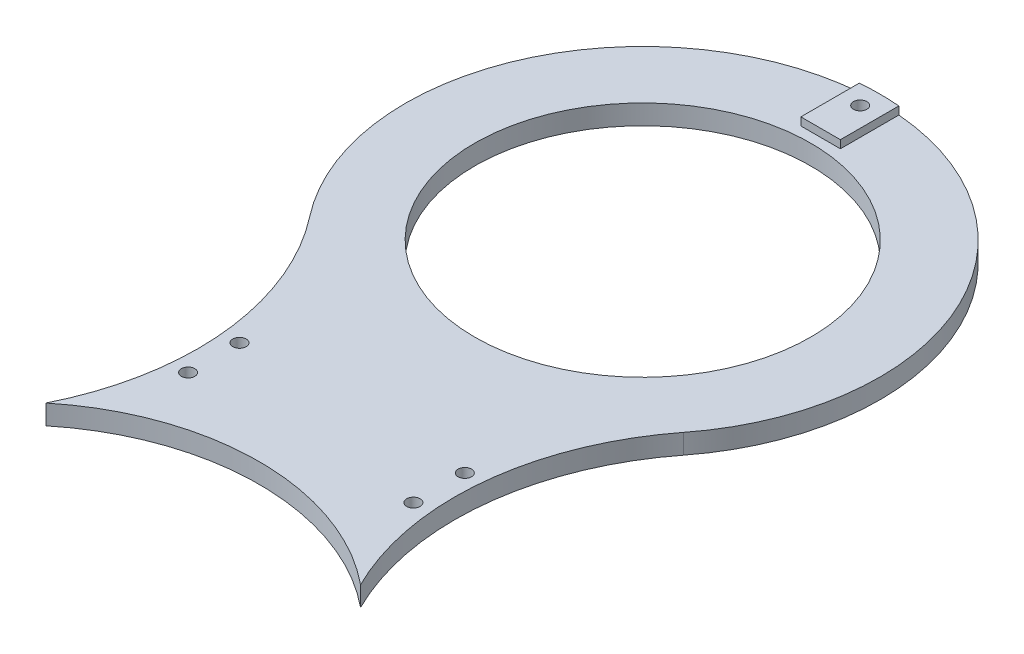
ISO-10303-21;
HEADER;
FILE_DESCRIPTION(('STEP AP214'),'2;1');
FILE_NAME('part.step','',(''),(''),'','','');
FILE_SCHEMA(('AUTOMOTIVE_DESIGN { 1 0 10303 214 1 1 1 1 }'));
ENDSEC;
DATA;
#1=APPLICATION_CONTEXT('core data for automotive mechanical design processes');
#2=APPLICATION_PROTOCOL_DEFINITION('international standard','automotive_design',2000,#1);
#3=PRODUCT_CONTEXT('',#1,'mechanical');
#4=PRODUCT('Part','Part','',(#3));
#5=PRODUCT_RELATED_PRODUCT_CATEGORY('part','',(#4));
#6=PRODUCT_DEFINITION_FORMATION('','',#4);
#7=PRODUCT_DEFINITION_CONTEXT('part definition',#1,'design');
#8=PRODUCT_DEFINITION('design','',#6,#7);
#9=PRODUCT_DEFINITION_SHAPE('','',#8);
#10=(LENGTH_UNIT() NAMED_UNIT(*) SI_UNIT(.MILLI.,.METRE.));
#11=(NAMED_UNIT(*) PLANE_ANGLE_UNIT() SI_UNIT($,.RADIAN.));
#12=(NAMED_UNIT(*) SI_UNIT($,.STERADIAN.) SOLID_ANGLE_UNIT());
#13=UNCERTAINTY_MEASURE_WITH_UNIT(LENGTH_MEASURE(1.E-05),#10,'distance_accuracy_value','');
#14=(GEOMETRIC_REPRESENTATION_CONTEXT(3) GLOBAL_UNCERTAINTY_ASSIGNED_CONTEXT((#13)) GLOBAL_UNIT_ASSIGNED_CONTEXT((#10,
#11,#12)) REPRESENTATION_CONTEXT('',''));
#15=CARTESIAN_POINT('',(0.,0.,0.));
#16=DIRECTION('',(0.,0.,1.));
#17=DIRECTION('',(1.,0.,0.));
#18=AXIS2_PLACEMENT_3D('',#15,#16,#17);
#19=CARTESIAN_POINT('',(0.,-14.,-215.));
#20=DIRECTION('',(0.,1.,0.));
#21=DIRECTION('',(0.,0.,1.));
#22=AXIS2_PLACEMENT_3D('',#19,#20,#21);
#23=CYLINDRICAL_SURFACE('',#22,1.7);
#24=CARTESIAN_POINT('',(0.,7.,-215.));
#25=DIRECTION('',(0.,1.,0.));
#26=DIRECTION('',(0.,0.,1.));
#27=AXIS2_PLACEMENT_3D('',#24,#25,#26);
#28=CIRCLE('',#27,1.7);
#29=CARTESIAN_POINT('',(0.,7.,-213.3));
#30=VERTEX_POINT('',#29);
#31=EDGE_CURVE('E166',#30,#30,#28,.T.);
#32=ORIENTED_EDGE('',*,*,#31,.T.);
#33=EDGE_LOOP('',(#32));
#34=FACE_BOUND('',#33,.T.);
#35=CARTESIAN_POINT('',(0.,3.,-215.));
#36=DIRECTION('',(0.,-1.,0.));
#37=DIRECTION('',(0.,0.,-1.));
#38=AXIS2_PLACEMENT_3D('',#35,#36,#37);
#39=CIRCLE('',#38,1.7);
#40=CARTESIAN_POINT('',(0.,3.,-216.7));
#41=VERTEX_POINT('',#40);
#42=EDGE_CURVE('E40',#41,#41,#39,.F.);
#43=ORIENTED_EDGE('',*,*,#42,.F.);
#44=EDGE_LOOP('',(#43));
#45=FACE_BOUND('',#44,.T.);
#46=ADVANCED_FACE('F36',(#34,#45),#23,.F.);
#47=CARTESIAN_POINT('',(51.2349101565567,5.,-40.0002002348816));
#48=DIRECTION('',(0.,1.,0.));
#49=DIRECTION('',(0.,0.,1.));
#50=AXIS2_PLACEMENT_3D('',#47,#48,#49);
#51=PLANE('',#50);
#52=CARTESIAN_POINT('',(-28.5,5.,-86.5));
#53=DIRECTION('',(0.,1.,0.));
#54=DIRECTION('',(0.,0.,1.));
#55=AXIS2_PLACEMENT_3D('',#52,#53,#54);
#56=CIRCLE('',#55,1.7);
#57=CARTESIAN_POINT('',(-28.5,5.,-84.8));
#58=VERTEX_POINT('',#57);
#59=EDGE_CURVE('E176',#58,#58,#56,.T.);
#60=ORIENTED_EDGE('',*,*,#59,.F.);
#61=EDGE_LOOP('',(#60));
#62=FACE_BOUND('',#61,.T.);
#63=CARTESIAN_POINT('',(-28.5,5.,-73.5));
#64=DIRECTION('',(0.,1.,0.));
#65=DIRECTION('',(0.,0.,1.));
#66=AXIS2_PLACEMENT_3D('',#63,#64,#65);
#67=CIRCLE('',#66,1.7);
#68=CARTESIAN_POINT('',(-28.5,5.,-71.8));
#69=VERTEX_POINT('',#68);
#70=EDGE_CURVE('E173',#69,#69,#67,.T.);
#71=ORIENTED_EDGE('',*,*,#70,.F.);
#72=EDGE_LOOP('',(#71));
#73=FACE_BOUND('',#72,.T.);
#74=CARTESIAN_POINT('',(28.5,5.,-73.5));
#75=DIRECTION('',(0.,1.,0.));
#76=DIRECTION('',(0.,0.,1.));
#77=AXIS2_PLACEMENT_3D('',#74,#75,#76);
#78=CIRCLE('',#77,1.7);
#79=CARTESIAN_POINT('',(28.5,5.,-71.8));
#80=VERTEX_POINT('',#79);
#81=EDGE_CURVE('E170',#80,#80,#78,.T.);
#82=ORIENTED_EDGE('',*,*,#81,.F.);
#83=EDGE_LOOP('',(#82));
#84=FACE_BOUND('',#83,.T.);
#85=CARTESIAN_POINT('',(28.5,5.,-86.5));
#86=DIRECTION('',(0.,1.,0.));
#87=DIRECTION('',(0.,0.,1.));
#88=AXIS2_PLACEMENT_3D('',#85,#86,#87);
#89=CIRCLE('',#88,1.7);
#90=CARTESIAN_POINT('',(28.5,5.,-84.8));
#91=VERTEX_POINT('',#90);
#92=EDGE_CURVE('E165',#91,#91,#89,.T.);
#93=ORIENTED_EDGE('',*,*,#92,.F.);
#94=EDGE_LOOP('',(#93));
#95=FACE_BOUND('',#94,.T.);
#96=DIRECTION('',(0.,0.,-1.));
#97=VECTOR('',#96,1.);
#98=CARTESIAN_POINT('',(5.00000000000002,5.,-205.));
#99=LINE('',#98,#97);
#100=CARTESIAN_POINT('',(5.00000000000002,5.,-205.));
#101=VERTEX_POINT('',#100);
#102=CARTESIAN_POINT('',(5.00000000000002,5.,-219.791303715507));
#103=VERTEX_POINT('',#102);
#104=EDGE_CURVE('E53',#101,#103,#99,.T.);
#105=ORIENTED_EDGE('',*,*,#104,.F.);
#106=DIRECTION('',(1.,0.,0.));
#107=VECTOR('',#106,1.);
#108=CARTESIAN_POINT('',(5.00000000000002,5.,-205.));
#109=LINE('',#108,#107);
#110=CARTESIAN_POINT('',(-4.99999999999998,5.,-205.));
#111=VERTEX_POINT('',#110);
#112=EDGE_CURVE('E121',#111,#101,#109,.T.);
#113=ORIENTED_EDGE('',*,*,#112,.F.);
#114=DIRECTION('',(0.,0.,1.));
#115=VECTOR('',#114,1.);
#116=CARTESIAN_POINT('',(-4.99999999999998,5.,-205.));
#117=LINE('',#116,#115);
#118=CARTESIAN_POINT('',(-4.99999999999998,5.,-219.791303715507));
#119=VERTEX_POINT('',#118);
#120=EDGE_CURVE('E59',#119,#111,#117,.T.);
#121=ORIENTED_EDGE('',*,*,#120,.F.);
#122=CARTESIAN_POINT('',(0.,5.,-160.));
#123=DIRECTION('',(0.,1.,0.));
#124=DIRECTION('',(0.,0.,1.));
#125=AXIS2_PLACEMENT_3D('',#122,#123,#124);
#126=CIRCLE('',#125,60.);
#127=CARTESIAN_POINT('',(-47.2937632214369,5.,-123.077107909121));
#128=VERTEX_POINT('',#127);
#129=EDGE_CURVE('E139',#119,#128,#126,.T.);
#130=ORIENTED_EDGE('',*,*,#129,.T.);
#131=CARTESIAN_POINT('',(-102.469820313113,5.,-80.0004004697632));
#132=DIRECTION('',(0.,-1.,0.));
#133=DIRECTION('',(0.,0.,1.));
#134=AXIS2_PLACEMENT_3D('',#131,#132,#133);
#135=CIRCLE('',#134,70.);
#136=CARTESIAN_POINT('',(-39.7828794835165,5.,-48.85));
#137=VERTEX_POINT('',#136);
#138=EDGE_CURVE('E143',#128,#137,#135,.T.);
#139=ORIENTED_EDGE('',*,*,#138,.T.);
#140=CARTESIAN_POINT('',(0.,5.,0.));
#141=DIRECTION('',(0.,-1.,0.));
#142=DIRECTION('',(0.,0.,1.));
#143=AXIS2_PLACEMENT_3D('',#140,#141,#142);
#144=CIRCLE('',#143,63.);
#145=CARTESIAN_POINT('',(39.7828794835165,5.,-48.85));
#146=VERTEX_POINT('',#145);
#147=EDGE_CURVE('E145',#137,#146,#144,.T.);
#148=ORIENTED_EDGE('',*,*,#147,.T.);
#149=CARTESIAN_POINT('',(102.469820313113,5.,-80.0004004697632));
#150=DIRECTION('',(0.,-1.,0.));
#151=DIRECTION('',(0.,0.,1.));
#152=AXIS2_PLACEMENT_3D('',#149,#150,#151);
#153=CIRCLE('',#152,70.);
#154=CARTESIAN_POINT('',(47.2937632214369,5.,-123.077107909121));
#155=VERTEX_POINT('',#154);
#156=EDGE_CURVE('E136',#146,#155,#153,.T.);
#157=ORIENTED_EDGE('',*,*,#156,.T.);
#158=EDGE_CURVE('E141',#155,#103,#126,.T.);
#159=ORIENTED_EDGE('',*,*,#158,.T.);
#160=EDGE_LOOP('',(#105,#113,#121,#130,#139,#148,#157,#159));
#161=FACE_BOUND('',#160,.T.);
#162=CARTESIAN_POINT('',(0.,5.,-160.));
#163=DIRECTION('',(0.,1.,0.));
#164=DIRECTION('',(0.,0.,1.));
#165=AXIS2_PLACEMENT_3D('',#162,#163,#164);
#166=CIRCLE('',#165,42.5);
#167=CARTESIAN_POINT('',(0.,5.,-117.5));
#168=VERTEX_POINT('',#167);
#169=EDGE_CURVE('E127',#168,#168,#166,.T.);
#170=ORIENTED_EDGE('',*,*,#169,.F.);
#171=EDGE_LOOP('',(#170));
#172=FACE_BOUND('',#171,.T.);
#173=ADVANCED_FACE('F210',(#62,#73,#84,#95,#161,#172),#51,.T.);
#174=CARTESIAN_POINT('',(51.2349101565567,0.,-40.0002002348816));
#175=DIRECTION('',(0.,1.,0.));
#176=DIRECTION('',(0.,0.,1.));
#177=AXIS2_PLACEMENT_3D('',#174,#175,#176);
#178=PLANE('',#177);
#179=CARTESIAN_POINT('',(0.,0.,-215.));
#180=DIRECTION('',(0.,-1.,0.));
#181=DIRECTION('',(0.,0.,-1.));
#182=AXIS2_PLACEMENT_3D('',#179,#180,#181);
#183=CIRCLE('',#182,2.95);
#184=CARTESIAN_POINT('',(0.,0.,-217.95));
#185=VERTEX_POINT('',#184);
#186=EDGE_CURVE('E250',#185,#185,#183,.T.);
#187=ORIENTED_EDGE('',*,*,#186,.F.);
#188=EDGE_LOOP('',(#187));
#189=FACE_BOUND('',#188,.T.);
#190=CARTESIAN_POINT('',(-28.5,0.,-86.5));
#191=DIRECTION('',(0.,1.,0.));
#192=DIRECTION('',(0.,0.,1.));
#193=AXIS2_PLACEMENT_3D('',#190,#191,#192);
#194=CIRCLE('',#193,1.7);
#195=CARTESIAN_POINT('',(-28.5,0.,-84.8));
#196=VERTEX_POINT('',#195);
#197=EDGE_CURVE('E174',#196,#196,#194,.T.);
#198=ORIENTED_EDGE('',*,*,#197,.T.);
#199=EDGE_LOOP('',(#198));
#200=FACE_BOUND('',#199,.T.);
#201=CARTESIAN_POINT('',(-28.5,0.,-73.5));
#202=DIRECTION('',(0.,1.,0.));
#203=DIRECTION('',(0.,0.,1.));
#204=AXIS2_PLACEMENT_3D('',#201,#202,#203);
#205=CIRCLE('',#204,1.7);
#206=CARTESIAN_POINT('',(-28.5,0.,-71.8));
#207=VERTEX_POINT('',#206);
#208=EDGE_CURVE('E171',#207,#207,#205,.T.);
#209=ORIENTED_EDGE('',*,*,#208,.T.);
#210=EDGE_LOOP('',(#209));
#211=FACE_BOUND('',#210,.T.);
#212=CARTESIAN_POINT('',(28.5,0.,-73.5));
#213=DIRECTION('',(0.,1.,0.));
#214=DIRECTION('',(0.,0.,1.));
#215=AXIS2_PLACEMENT_3D('',#212,#213,#214);
#216=CIRCLE('',#215,1.7);
#217=CARTESIAN_POINT('',(28.5,0.,-71.8));
#218=VERTEX_POINT('',#217);
#219=EDGE_CURVE('E167',#218,#218,#216,.T.);
#220=ORIENTED_EDGE('',*,*,#219,.T.);
#221=EDGE_LOOP('',(#220));
#222=FACE_BOUND('',#221,.T.);
#223=CARTESIAN_POINT('',(28.5,0.,-86.5));
#224=DIRECTION('',(0.,1.,0.));
#225=DIRECTION('',(0.,0.,1.));
#226=AXIS2_PLACEMENT_3D('',#223,#224,#225);
#227=CIRCLE('',#226,1.7);
#228=CARTESIAN_POINT('',(28.5,0.,-84.8));
#229=VERTEX_POINT('',#228);
#230=EDGE_CURVE('E162',#229,#229,#227,.T.);
#231=ORIENTED_EDGE('',*,*,#230,.T.);
#232=EDGE_LOOP('',(#231));
#233=FACE_BOUND('',#232,.T.);
#234=CARTESIAN_POINT('',(102.469820313113,0.,-80.0004004697632));
#235=DIRECTION('',(0.,-1.,0.));
#236=DIRECTION('',(0.,0.,1.));
#237=AXIS2_PLACEMENT_3D('',#234,#235,#236);
#238=CIRCLE('',#237,70.);
#239=CARTESIAN_POINT('',(39.7828794835165,0.,-48.85));
#240=VERTEX_POINT('',#239);
#241=CARTESIAN_POINT('',(47.2937632214369,0.,-123.077107909121));
#242=VERTEX_POINT('',#241);
#243=EDGE_CURVE('E134',#240,#242,#238,.T.);
#244=ORIENTED_EDGE('',*,*,#243,.F.);
#245=CARTESIAN_POINT('',(0.,0.,0.));
#246=DIRECTION('',(0.,-1.,0.));
#247=DIRECTION('',(0.,0.,1.));
#248=AXIS2_PLACEMENT_3D('',#245,#246,#247);
#249=CIRCLE('',#248,63.);
#250=CARTESIAN_POINT('',(-39.7828794835165,0.,-48.85));
#251=VERTEX_POINT('',#250);
#252=EDGE_CURVE('E140',#251,#240,#249,.T.);
#253=ORIENTED_EDGE('',*,*,#252,.F.);
#254=CARTESIAN_POINT('',(-102.469820313113,0.,-80.0004004697632));
#255=DIRECTION('',(0.,-1.,0.));
#256=DIRECTION('',(0.,0.,1.));
#257=AXIS2_PLACEMENT_3D('',#254,#255,#256);
#258=CIRCLE('',#257,70.);
#259=CARTESIAN_POINT('',(-47.2937632214369,0.,-123.077107909121));
#260=VERTEX_POINT('',#259);
#261=EDGE_CURVE('E152',#260,#251,#258,.T.);
#262=ORIENTED_EDGE('',*,*,#261,.F.);
#263=CARTESIAN_POINT('',(0.,0.,-160.));
#264=DIRECTION('',(0.,1.,0.));
#265=DIRECTION('',(0.,0.,1.));
#266=AXIS2_PLACEMENT_3D('',#263,#264,#265);
#267=CIRCLE('',#266,60.);
#268=EDGE_CURVE('E150',#242,#260,#267,.T.);
#269=ORIENTED_EDGE('',*,*,#268,.F.);
#270=EDGE_LOOP('',(#244,#253,#262,#269));
#271=FACE_BOUND('',#270,.T.);
#272=CARTESIAN_POINT('',(0.,0.,-160.));
#273=DIRECTION('',(0.,1.,0.));
#274=DIRECTION('',(0.,0.,1.));
#275=AXIS2_PLACEMENT_3D('',#272,#273,#274);
#276=CIRCLE('',#275,42.5);
#277=CARTESIAN_POINT('',(0.,0.,-117.5));
#278=VERTEX_POINT('',#277);
#279=EDGE_CURVE('E124',#278,#278,#276,.T.);
#280=ORIENTED_EDGE('',*,*,#279,.T.);
#281=EDGE_LOOP('',(#280));
#282=FACE_BOUND('',#281,.T.);
#283=ADVANCED_FACE('F216',(#189,#200,#211,#222,#233,#271,#282),#178,.F.);
#284=CARTESIAN_POINT('',(102.469820313113,5.,-80.0004004697632));
#285=DIRECTION('',(0.,-1.,0.));
#286=DIRECTION('',(0.,0.,-1.));
#287=AXIS2_PLACEMENT_3D('',#284,#285,#286);
#288=CYLINDRICAL_SURFACE('',#287,70.);
#289=ORIENTED_EDGE('',*,*,#243,.T.);
#290=DIRECTION('',(0.,-1.,0.));
#291=VECTOR('',#290,1.);
#292=CARTESIAN_POINT('',(47.2937632214369,5.,-123.077107909121));
#293=LINE('',#292,#291);
#294=EDGE_CURVE('E11',#155,#242,#293,.T.);
#295=ORIENTED_EDGE('',*,*,#294,.F.);
#296=ORIENTED_EDGE('',*,*,#156,.F.);
#297=DIRECTION('',(0.,-1.,0.));
#298=VECTOR('',#297,1.);
#299=CARTESIAN_POINT('',(39.7828794835165,5.,-48.85));
#300=LINE('',#299,#298);
#301=EDGE_CURVE('E147',#146,#240,#300,.T.);
#302=ORIENTED_EDGE('',*,*,#301,.T.);
#303=EDGE_LOOP('',(#289,#295,#296,#302));
#304=FACE_BOUND('',#303,.T.);
#305=ADVANCED_FACE('F38',(#304),#288,.F.);
#306=CARTESIAN_POINT('',(0.,5.,-160.));
#307=DIRECTION('',(0.,-1.,0.));
#308=DIRECTION('',(0.,0.,-1.));
#309=AXIS2_PLACEMENT_3D('',#306,#307,#308);
#310=CYLINDRICAL_SURFACE('',#309,60.);
#311=ORIENTED_EDGE('',*,*,#268,.T.);
#312=DIRECTION('',(0.,-1.,0.));
#313=VECTOR('',#312,1.);
#314=CARTESIAN_POINT('',(-47.2937632214369,5.,-123.077107909121));
#315=LINE('',#314,#313);
#316=EDGE_CURVE('E45',#128,#260,#315,.T.);
#317=ORIENTED_EDGE('',*,*,#316,.F.);
#318=ORIENTED_EDGE('',*,*,#129,.F.);
#319=DIRECTION('',(0.,-1.,0.));
#320=VECTOR('',#319,1.);
#321=CARTESIAN_POINT('',(-4.99999999999998,7.,-219.791303715507));
#322=LINE('',#321,#320);
#323=CARTESIAN_POINT('',(-4.99999999999998,7.,-219.791303715507));
#324=VERTEX_POINT('',#323);
#325=EDGE_CURVE('E108',#324,#119,#322,.T.);
#326=ORIENTED_EDGE('',*,*,#325,.F.);
#327=CARTESIAN_POINT('',(0.,7.,-160.));
#328=DIRECTION('',(0.,1.,0.));
#329=DIRECTION('',(0.,0.,1.));
#330=AXIS2_PLACEMENT_3D('',#327,#328,#329);
#331=CIRCLE('',#330,60.);
#332=CARTESIAN_POINT('',(5.00000000000001,7.,-219.791303715507));
#333=VERTEX_POINT('',#332);
#334=EDGE_CURVE('E102',#333,#324,#331,.T.);
#335=ORIENTED_EDGE('',*,*,#334,.F.);
#336=DIRECTION('',(0.,-1.,0.));
#337=VECTOR('',#336,1.);
#338=CARTESIAN_POINT('',(5.00000000000001,7.,-219.791303715507));
#339=LINE('',#338,#337);
#340=EDGE_CURVE('E106',#333,#103,#339,.T.);
#341=ORIENTED_EDGE('',*,*,#340,.T.);
#342=ORIENTED_EDGE('',*,*,#158,.F.);
#343=ORIENTED_EDGE('',*,*,#294,.T.);
#344=EDGE_LOOP('',(#311,#317,#318,#326,#335,#341,#342,#343));
#345=FACE_BOUND('',#344,.T.);
#346=ADVANCED_FACE('F104',(#345),#310,.T.);
#347=CARTESIAN_POINT('',(-102.469820313113,5.,-80.0004004697632));
#348=DIRECTION('',(0.,-1.,0.));
#349=DIRECTION('',(0.,0.,-1.));
#350=AXIS2_PLACEMENT_3D('',#347,#348,#349);
#351=CYLINDRICAL_SURFACE('',#350,70.);
#352=ORIENTED_EDGE('',*,*,#261,.T.);
#353=DIRECTION('',(0.,-1.,0.));
#354=VECTOR('',#353,1.);
#355=CARTESIAN_POINT('',(-39.7828794835165,5.,-48.85));
#356=LINE('',#355,#354);
#357=EDGE_CURVE('E157',#137,#251,#356,.T.);
#358=ORIENTED_EDGE('',*,*,#357,.F.);
#359=ORIENTED_EDGE('',*,*,#138,.F.);
#360=ORIENTED_EDGE('',*,*,#316,.T.);
#361=EDGE_LOOP('',(#352,#358,#359,#360));
#362=FACE_BOUND('',#361,.T.);
#363=ADVANCED_FACE('F276',(#362),#351,.F.);
#364=CARTESIAN_POINT('',(0.,5.,0.));
#365=DIRECTION('',(0.,-1.,0.));
#366=DIRECTION('',(0.,0.,-1.));
#367=AXIS2_PLACEMENT_3D('',#364,#365,#366);
#368=CYLINDRICAL_SURFACE('',#367,63.);
#369=ORIENTED_EDGE('',*,*,#252,.T.);
#370=ORIENTED_EDGE('',*,*,#301,.F.);
#371=ORIENTED_EDGE('',*,*,#147,.F.);
#372=ORIENTED_EDGE('',*,*,#357,.T.);
#373=EDGE_LOOP('',(#369,#370,#371,#372));
#374=FACE_BOUND('',#373,.T.);
#375=ADVANCED_FACE('F261',(#374),#368,.F.);
#376=CARTESIAN_POINT('',(0.,5.,-160.));
#377=DIRECTION('',(0.,-1.,0.));
#378=DIRECTION('',(0.,0.,-1.));
#379=AXIS2_PLACEMENT_3D('',#376,#377,#378);
#380=CYLINDRICAL_SURFACE('',#379,42.5);
#381=ORIENTED_EDGE('',*,*,#169,.T.);
#382=EDGE_LOOP('',(#381));
#383=FACE_BOUND('',#382,.T.);
#384=ORIENTED_EDGE('',*,*,#279,.F.);
#385=EDGE_LOOP('',(#384));
#386=FACE_BOUND('',#385,.T.);
#387=ADVANCED_FACE('F207',(#383,#386),#380,.F.);
#388=CARTESIAN_POINT('',(5.00000000000002,7.,-205.));
#389=DIRECTION('',(-1.,0.,0.));
#390=DIRECTION('',(0.,0.,1.));
#391=AXIS2_PLACEMENT_3D('',#388,#389,#390);
#392=PLANE('',#391);
#393=ORIENTED_EDGE('',*,*,#104,.T.);
#394=ORIENTED_EDGE('',*,*,#340,.F.);
#395=DIRECTION('',(0.,0.,-1.));
#396=VECTOR('',#395,1.);
#397=CARTESIAN_POINT('',(5.00000000000002,7.,-205.));
#398=LINE('',#397,#396);
#399=CARTESIAN_POINT('',(5.00000000000002,7.,-205.));
#400=VERTEX_POINT('',#399);
#401=EDGE_CURVE('E112',#400,#333,#398,.T.);
#402=ORIENTED_EDGE('',*,*,#401,.F.);
#403=DIRECTION('',(0.,-1.,0.));
#404=VECTOR('',#403,1.);
#405=CARTESIAN_POINT('',(5.00000000000002,7.,-205.));
#406=LINE('',#405,#404);
#407=EDGE_CURVE('E190',#400,#101,#406,.T.);
#408=ORIENTED_EDGE('',*,*,#407,.T.);
#409=EDGE_LOOP('',(#393,#394,#402,#408));
#410=FACE_BOUND('',#409,.T.);
#411=ADVANCED_FACE('F123',(#410),#392,.F.);
#412=CARTESIAN_POINT('',(-4.99999999999998,7.,-205.));
#413=DIRECTION('',(1.,0.,0.));
#414=DIRECTION('',(0.,0.,-1.));
#415=AXIS2_PLACEMENT_3D('',#412,#413,#414);
#416=PLANE('',#415);
#417=ORIENTED_EDGE('',*,*,#120,.T.);
#418=DIRECTION('',(0.,-1.,0.));
#419=VECTOR('',#418,1.);
#420=CARTESIAN_POINT('',(-4.99999999999998,7.,-205.));
#421=LINE('',#420,#419);
#422=CARTESIAN_POINT('',(-4.99999999999998,7.,-205.));
#423=VERTEX_POINT('',#422);
#424=EDGE_CURVE('E129',#423,#111,#421,.T.);
#425=ORIENTED_EDGE('',*,*,#424,.F.);
#426=DIRECTION('',(0.,0.,1.));
#427=VECTOR('',#426,1.);
#428=CARTESIAN_POINT('',(-4.99999999999998,7.,-205.));
#429=LINE('',#428,#427);
#430=EDGE_CURVE('E111',#324,#423,#429,.T.);
#431=ORIENTED_EDGE('',*,*,#430,.F.);
#432=ORIENTED_EDGE('',*,*,#325,.T.);
#433=EDGE_LOOP('',(#417,#425,#431,#432));
#434=FACE_BOUND('',#433,.T.);
#435=ADVANCED_FACE('F199',(#434),#416,.F.);
#436=CARTESIAN_POINT('',(5.00000000000002,7.,-205.));
#437=DIRECTION('',(0.,0.,-1.));
#438=DIRECTION('',(-1.,0.,0.));
#439=AXIS2_PLACEMENT_3D('',#436,#437,#438);
#440=PLANE('',#439);
#441=ORIENTED_EDGE('',*,*,#112,.T.);
#442=ORIENTED_EDGE('',*,*,#407,.F.);
#443=DIRECTION('',(1.,0.,0.));
#444=VECTOR('',#443,1.);
#445=CARTESIAN_POINT('',(5.00000000000002,7.,-205.));
#446=LINE('',#445,#444);
#447=EDGE_CURVE('E117',#423,#400,#446,.T.);
#448=ORIENTED_EDGE('',*,*,#447,.F.);
#449=ORIENTED_EDGE('',*,*,#424,.T.);
#450=EDGE_LOOP('',(#441,#442,#448,#449));
#451=FACE_BOUND('',#450,.T.);
#452=ADVANCED_FACE('F197',(#451),#440,.F.);
#453=CARTESIAN_POINT('',(0.,7.,-160.));
#454=DIRECTION('',(0.,1.,0.));
#455=DIRECTION('',(0.,0.,1.));
#456=AXIS2_PLACEMENT_3D('',#453,#454,#455);
#457=PLANE('',#456);
#458=ORIENTED_EDGE('',*,*,#31,.F.);
#459=EDGE_LOOP('',(#458));
#460=FACE_BOUND('',#459,.T.);
#461=ORIENTED_EDGE('',*,*,#401,.T.);
#462=ORIENTED_EDGE('',*,*,#334,.T.);
#463=ORIENTED_EDGE('',*,*,#430,.T.);
#464=ORIENTED_EDGE('',*,*,#447,.T.);
#465=EDGE_LOOP('',(#461,#462,#463,#464));
#466=FACE_BOUND('',#465,.T.);
#467=ADVANCED_FACE('F115',(#460,#466),#457,.T.);
#468=CARTESIAN_POINT('',(28.5,-14.,-86.5));
#469=DIRECTION('',(0.,1.,0.));
#470=DIRECTION('',(0.,0.,1.));
#471=AXIS2_PLACEMENT_3D('',#468,#469,#470);
#472=CYLINDRICAL_SURFACE('',#471,1.7);
#473=ORIENTED_EDGE('',*,*,#92,.T.);
#474=EDGE_LOOP('',(#473));
#475=FACE_BOUND('',#474,.T.);
#476=ORIENTED_EDGE('',*,*,#230,.F.);
#477=EDGE_LOOP('',(#476));
#478=FACE_BOUND('',#477,.T.);
#479=ADVANCED_FACE('F236',(#475,#478),#472,.F.);
#480=CARTESIAN_POINT('',(28.5,-14.,-73.5));
#481=DIRECTION('',(0.,1.,0.));
#482=DIRECTION('',(0.,0.,1.));
#483=AXIS2_PLACEMENT_3D('',#480,#481,#482);
#484=CYLINDRICAL_SURFACE('',#483,1.7);
#485=ORIENTED_EDGE('',*,*,#81,.T.);
#486=EDGE_LOOP('',(#485));
#487=FACE_BOUND('',#486,.T.);
#488=ORIENTED_EDGE('',*,*,#219,.F.);
#489=EDGE_LOOP('',(#488));
#490=FACE_BOUND('',#489,.T.);
#491=ADVANCED_FACE('F233',(#487,#490),#484,.F.);
#492=CARTESIAN_POINT('',(-28.5,-14.,-73.5));
#493=DIRECTION('',(0.,1.,0.));
#494=DIRECTION('',(0.,0.,1.));
#495=AXIS2_PLACEMENT_3D('',#492,#493,#494);
#496=CYLINDRICAL_SURFACE('',#495,1.7);
#497=ORIENTED_EDGE('',*,*,#70,.T.);
#498=EDGE_LOOP('',(#497));
#499=FACE_BOUND('',#498,.T.);
#500=ORIENTED_EDGE('',*,*,#208,.F.);
#501=EDGE_LOOP('',(#500));
#502=FACE_BOUND('',#501,.T.);
#503=ADVANCED_FACE('F229',(#499,#502),#496,.F.);
#504=CARTESIAN_POINT('',(-28.5,-14.,-86.5));
#505=DIRECTION('',(0.,1.,0.));
#506=DIRECTION('',(0.,0.,1.));
#507=AXIS2_PLACEMENT_3D('',#504,#505,#506);
#508=CYLINDRICAL_SURFACE('',#507,1.7);
#509=ORIENTED_EDGE('',*,*,#59,.T.);
#510=EDGE_LOOP('',(#509));
#511=FACE_BOUND('',#510,.T.);
#512=ORIENTED_EDGE('',*,*,#197,.F.);
#513=EDGE_LOOP('',(#512));
#514=FACE_BOUND('',#513,.T.);
#515=ADVANCED_FACE('F225',(#511,#514),#508,.F.);
#516=CARTESIAN_POINT('',(0.,3.,-215.));
#517=DIRECTION('',(0.,-1.,0.));
#518=DIRECTION('',(0.,0.,-1.));
#519=AXIS2_PLACEMENT_3D('',#516,#517,#518);
#520=PLANE('',#519);
#521=CARTESIAN_POINT('',(0.,3.,-215.));
#522=DIRECTION('',(0.,-1.,0.));
#523=DIRECTION('',(0.,0.,-1.));
#524=AXIS2_PLACEMENT_3D('',#521,#522,#523);
#525=CIRCLE('',#524,2.95);
#526=CARTESIAN_POINT('',(0.,3.,-217.95));
#527=VERTEX_POINT('',#526);
#528=EDGE_CURVE('E248',#527,#527,#525,.T.);
#529=ORIENTED_EDGE('',*,*,#528,.T.);
#530=EDGE_LOOP('',(#529));
#531=FACE_BOUND('',#530,.T.);
#532=ORIENTED_EDGE('',*,*,#42,.T.);
#533=EDGE_LOOP('',(#532));
#534=FACE_BOUND('',#533,.T.);
#535=ADVANCED_FACE('F228',(#531,#534),#520,.T.);
#536=CARTESIAN_POINT('',(0.,3.,-215.));
#537=DIRECTION('',(0.,-1.,0.));
#538=DIRECTION('',(0.,0.,-1.));
#539=AXIS2_PLACEMENT_3D('',#536,#537,#538);
#540=CYLINDRICAL_SURFACE('',#539,2.95);
#541=ORIENTED_EDGE('',*,*,#528,.F.);
#542=EDGE_LOOP('',(#541));
#543=FACE_BOUND('',#542,.T.);
#544=ORIENTED_EDGE('',*,*,#186,.T.);
#545=EDGE_LOOP('',(#544));
#546=FACE_BOUND('',#545,.T.);
#547=ADVANCED_FACE('F223',(#543,#546),#540,.F.);
#548=CLOSED_SHELL('',(#46,#173,#283,#305,#346,#363,#375,#387,#411,#435,#452,#467,#479,#491,#503,
#515,#535,#547));
#549=MANIFOLD_SOLID_BREP('B2',#548);
#550=ADVANCED_BREP_SHAPE_REPRESENTATION('',(#18,#549),#14);
#551=SHAPE_DEFINITION_REPRESENTATION(#9,#550);
ENDSEC;
END-ISO-10303-21;
